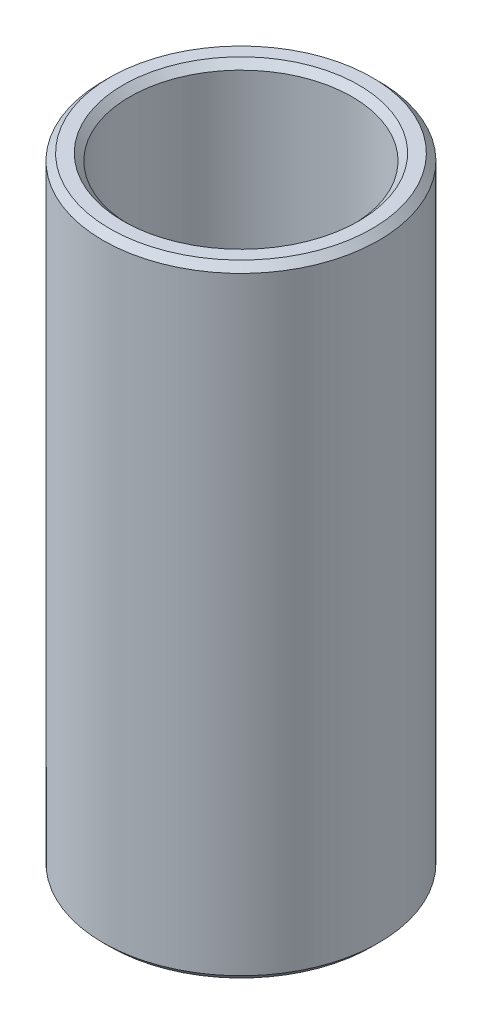
ISO-10303-21;
HEADER;
FILE_DESCRIPTION(('STEP AP214'),'2;1');
FILE_NAME('part.step','',(''),(''),'','','');
FILE_SCHEMA(('AUTOMOTIVE_DESIGN { 1 0 10303 214 1 1 1 1 }'));
ENDSEC;
DATA;
#1=APPLICATION_CONTEXT('core data for automotive mechanical design processes');
#2=APPLICATION_PROTOCOL_DEFINITION('international standard','automotive_design',2000,#1);
#3=PRODUCT_CONTEXT('',#1,'mechanical');
#4=PRODUCT('Part','Part','',(#3));
#5=PRODUCT_RELATED_PRODUCT_CATEGORY('part','',(#4));
#6=PRODUCT_DEFINITION_FORMATION('','',#4);
#7=PRODUCT_DEFINITION_CONTEXT('part definition',#1,'design');
#8=PRODUCT_DEFINITION('design','',#6,#7);
#9=PRODUCT_DEFINITION_SHAPE('','',#8);
#10=(LENGTH_UNIT() NAMED_UNIT(*) SI_UNIT(.MILLI.,.METRE.));
#11=(NAMED_UNIT(*) PLANE_ANGLE_UNIT() SI_UNIT($,.RADIAN.));
#12=(NAMED_UNIT(*) SI_UNIT($,.STERADIAN.) SOLID_ANGLE_UNIT());
#13=UNCERTAINTY_MEASURE_WITH_UNIT(LENGTH_MEASURE(1.E-05),#10,'distance_accuracy_value','');
#14=(GEOMETRIC_REPRESENTATION_CONTEXT(3) GLOBAL_UNCERTAINTY_ASSIGNED_CONTEXT((#13)) GLOBAL_UNIT_ASSIGNED_CONTEXT((#10,
#11,#12)) REPRESENTATION_CONTEXT('',''));
#15=CARTESIAN_POINT('',(0.,0.,0.));
#16=DIRECTION('',(0.,0.,1.));
#17=DIRECTION('',(1.,0.,0.));
#18=AXIS2_PLACEMENT_3D('',#15,#16,#17);
#19=CARTESIAN_POINT('',(0.,202.935803828685,0.));
#20=DIRECTION('',(0.,-1.,0.));
#21=DIRECTION('',(0.,0.,-1.));
#22=AXIS2_PLACEMENT_3D('',#19,#20,#21);
#23=CYLINDRICAL_SURFACE('',#22,45.);
#24=CARTESIAN_POINT('',(0.,2.20729333880471,0.));
#25=DIRECTION('',(0.,1.,0.));
#26=DIRECTION('',(0.,0.,1.));
#27=AXIS2_PLACEMENT_3D('',#24,#25,#26);
#28=CIRCLE('',#27,45.);
#29=CARTESIAN_POINT('',(0.,2.20729333880471,45.));
#30=VERTEX_POINT('',#29);
#31=EDGE_CURVE('E10',#30,#30,#28,.T.);
#32=ORIENTED_EDGE('',*,*,#31,.T.);
#33=EDGE_LOOP('',(#32));
#34=FACE_BOUND('',#33,.T.);
#35=CARTESIAN_POINT('',(0.,200.72851048988,0.));
#36=DIRECTION('',(0.,1.,0.));
#37=DIRECTION('',(0.,0.,1.));
#38=AXIS2_PLACEMENT_3D('',#35,#36,#37);
#39=CIRCLE('',#38,45.);
#40=CARTESIAN_POINT('',(0.,200.72851048988,45.));
#41=VERTEX_POINT('',#40);
#42=EDGE_CURVE('E50',#41,#41,#39,.F.);
#43=ORIENTED_EDGE('',*,*,#42,.T.);
#44=EDGE_LOOP('',(#43));
#45=FACE_BOUND('',#44,.T.);
#46=ADVANCED_FACE('F39',(#34,#45),#23,.T.);
#47=CARTESIAN_POINT('',(0.,202.935803828685,0.));
#48=DIRECTION('',(0.,1.,0.));
#49=DIRECTION('',(0.,0.,1.));
#50=AXIS2_PLACEMENT_3D('',#47,#48,#49);
#51=PLANE('',#50);
#52=CARTESIAN_POINT('',(0.,202.935803828685,0.));
#53=DIRECTION('',(0.,1.,0.));
#54=DIRECTION('',(0.,0.,1.));
#55=AXIS2_PLACEMENT_3D('',#52,#53,#54);
#56=CIRCLE('',#55,38.4760885372148);
#57=CARTESIAN_POINT('',(0.,202.935803828685,38.4760885372148));
#58=VERTEX_POINT('',#57);
#59=EDGE_CURVE('E58',#58,#58,#56,.F.);
#60=ORIENTED_EDGE('',*,*,#59,.T.);
#61=EDGE_LOOP('',(#60));
#62=FACE_BOUND('',#61,.T.);
#63=CARTESIAN_POINT('',(0.,202.935803828685,0.));
#64=DIRECTION('',(0.,1.,0.));
#65=DIRECTION('',(0.,0.,1.));
#66=AXIS2_PLACEMENT_3D('',#63,#64,#65);
#67=CIRCLE('',#66,42.7927066611952);
#68=CARTESIAN_POINT('',(0.,202.935803828685,42.7927066611952));
#69=VERTEX_POINT('',#68);
#70=EDGE_CURVE('E61',#69,#69,#67,.T.);
#71=ORIENTED_EDGE('',*,*,#70,.T.);
#72=EDGE_LOOP('',(#71));
#73=FACE_BOUND('',#72,.T.);
#74=ADVANCED_FACE('F88',(#62,#73),#51,.T.);
#75=CARTESIAN_POINT('',(0.,0.,0.));
#76=DIRECTION('',(0.,1.,0.));
#77=DIRECTION('',(0.,0.,1.));
#78=AXIS2_PLACEMENT_3D('',#75,#76,#77);
#79=PLANE('',#78);
#80=CARTESIAN_POINT('',(0.,0.,0.));
#81=DIRECTION('',(0.,1.,0.));
#82=DIRECTION('',(0.,0.,1.));
#83=AXIS2_PLACEMENT_3D('',#80,#81,#82);
#84=CIRCLE('',#83,38.4760885372149);
#85=CARTESIAN_POINT('',(0.,0.,38.4760885372149));
#86=VERTEX_POINT('',#85);
#87=EDGE_CURVE('E51',#86,#86,#84,.T.);
#88=ORIENTED_EDGE('',*,*,#87,.T.);
#89=EDGE_LOOP('',(#88));
#90=FACE_BOUND('',#89,.T.);
#91=CARTESIAN_POINT('',(0.,0.,0.));
#92=DIRECTION('',(0.,1.,0.));
#93=DIRECTION('',(0.,0.,1.));
#94=AXIS2_PLACEMENT_3D('',#91,#92,#93);
#95=CIRCLE('',#94,42.7927066611953);
#96=CARTESIAN_POINT('',(0.,0.,42.7927066611953));
#97=VERTEX_POINT('',#96);
#98=EDGE_CURVE('E54',#97,#97,#95,.F.);
#99=ORIENTED_EDGE('',*,*,#98,.T.);
#100=EDGE_LOOP('',(#99));
#101=FACE_BOUND('',#100,.T.);
#102=ADVANCED_FACE('F83',(#90,#101),#79,.F.);
#103=CARTESIAN_POINT('',(0.,202.935803828685,0.));
#104=DIRECTION('',(0.,-1.,0.));
#105=DIRECTION('',(0.,0.,-1.));
#106=AXIS2_PLACEMENT_3D('',#103,#104,#105);
#107=CYLINDRICAL_SURFACE('',#106,36.2687951984101);
#108=CARTESIAN_POINT('',(0.,200.72851048988,0.));
#109=DIRECTION('',(0.,1.,0.));
#110=DIRECTION('',(0.,0.,1.));
#111=AXIS2_PLACEMENT_3D('',#108,#109,#110);
#112=CIRCLE('',#111,36.2687951984101);
#113=CARTESIAN_POINT('',(0.,200.72851048988,36.2687951984101));
#114=VERTEX_POINT('',#113);
#115=EDGE_CURVE('E67',#114,#114,#112,.T.);
#116=ORIENTED_EDGE('',*,*,#115,.T.);
#117=EDGE_LOOP('',(#116));
#118=FACE_BOUND('',#117,.T.);
#119=CARTESIAN_POINT('',(0.,2.20729333880476,0.));
#120=DIRECTION('',(0.,1.,0.));
#121=DIRECTION('',(0.,0.,1.));
#122=AXIS2_PLACEMENT_3D('',#119,#120,#121);
#123=CIRCLE('',#122,36.2687951984101);
#124=CARTESIAN_POINT('',(0.,2.20729333880476,36.2687951984101));
#125=VERTEX_POINT('',#124);
#126=EDGE_CURVE('E69',#125,#125,#123,.F.);
#127=ORIENTED_EDGE('',*,*,#126,.T.);
#128=EDGE_LOOP('',(#127));
#129=FACE_BOUND('',#128,.T.);
#130=ADVANCED_FACE('F71',(#118,#129),#107,.F.);
#131=CARTESIAN_POINT('',(0.,200.72851048988,0.));
#132=DIRECTION('',(0.,1.,0.));
#133=DIRECTION('',(0.,0.,1.));
#134=AXIS2_PLACEMENT_3D('',#131,#132,#133);
#135=CONICAL_SURFACE('',#134,36.2687951984101,0.785398163397445);
#136=ORIENTED_EDGE('',*,*,#59,.F.);
#137=EDGE_LOOP('',(#136));
#138=FACE_BOUND('',#137,.T.);
#139=ORIENTED_EDGE('',*,*,#115,.F.);
#140=EDGE_LOOP('',(#139));
#141=FACE_BOUND('',#140,.T.);
#142=ADVANCED_FACE('F77',(#138,#141),#135,.F.);
#143=CARTESIAN_POINT('',(0.,0.,0.));
#144=DIRECTION('',(0.,-1.,0.));
#145=DIRECTION('',(0.,0.,-1.));
#146=AXIS2_PLACEMENT_3D('',#143,#144,#145);
#147=CONICAL_SURFACE('',#146,38.4760885372149,0.785398163397451);
#148=ORIENTED_EDGE('',*,*,#126,.F.);
#149=EDGE_LOOP('',(#148));
#150=FACE_BOUND('',#149,.T.);
#151=ORIENTED_EDGE('',*,*,#87,.F.);
#152=EDGE_LOOP('',(#151));
#153=FACE_BOUND('',#152,.T.);
#154=ADVANCED_FACE('F73',(#150,#153),#147,.F.);
#155=CARTESIAN_POINT('',(0.,2.20729333880471,0.));
#156=DIRECTION('',(0.,1.,0.));
#157=DIRECTION('',(0.,0.,1.));
#158=AXIS2_PLACEMENT_3D('',#155,#156,#157);
#159=CONICAL_SURFACE('',#158,45.,0.785398163397448);
#160=ORIENTED_EDGE('',*,*,#98,.F.);
#161=EDGE_LOOP('',(#160));
#162=FACE_BOUND('',#161,.T.);
#163=ORIENTED_EDGE('',*,*,#31,.F.);
#164=EDGE_LOOP('',(#163));
#165=FACE_BOUND('',#164,.T.);
#166=ADVANCED_FACE('F76',(#162,#165),#159,.T.);
#167=CARTESIAN_POINT('',(0.,202.935803828685,0.));
#168=DIRECTION('',(0.,-1.,0.));
#169=DIRECTION('',(0.,0.,-1.));
#170=AXIS2_PLACEMENT_3D('',#167,#168,#169);
#171=CONICAL_SURFACE('',#170,42.7927066611952,0.785398163397448);
#172=ORIENTED_EDGE('',*,*,#42,.F.);
#173=EDGE_LOOP('',(#172));
#174=FACE_BOUND('',#173,.T.);
#175=ORIENTED_EDGE('',*,*,#70,.F.);
#176=EDGE_LOOP('',(#175));
#177=FACE_BOUND('',#176,.T.);
#178=ADVANCED_FACE('F45',(#174,#177),#171,.T.);
#179=CLOSED_SHELL('',(#46,#74,#102,#130,#142,#154,#166,#178));
#180=MANIFOLD_SOLID_BREP('B2',#179);
#181=ADVANCED_BREP_SHAPE_REPRESENTATION('',(#18,#180),#14);
#182=SHAPE_DEFINITION_REPRESENTATION(#9,#181);
ENDSEC;
END-ISO-10303-21;
